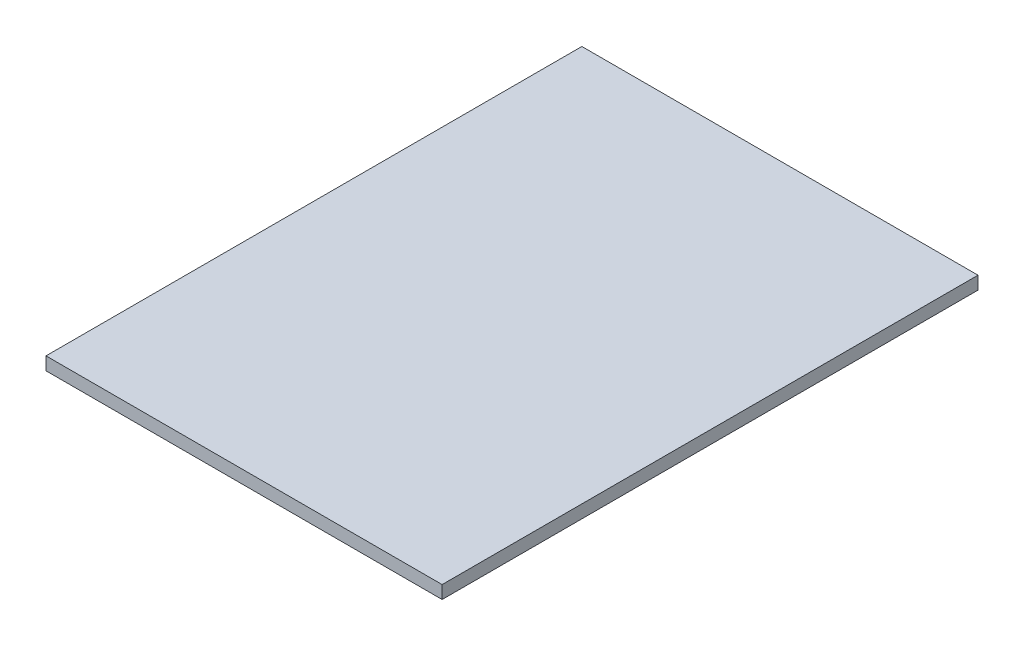
ISO-10303-21;
HEADER;
FILE_DESCRIPTION(('STEP AP214'),'2;1');
FILE_NAME('part.step','',(''),(''),'','','');
FILE_SCHEMA(('AUTOMOTIVE_DESIGN { 1 0 10303 214 1 1 1 1 }'));
ENDSEC;
DATA;
#1=APPLICATION_CONTEXT('core data for automotive mechanical design processes');
#2=APPLICATION_PROTOCOL_DEFINITION('international standard','automotive_design',2000,#1);
#3=PRODUCT_CONTEXT('',#1,'mechanical');
#4=PRODUCT('Part','Part','',(#3));
#5=PRODUCT_RELATED_PRODUCT_CATEGORY('part','',(#4));
#6=PRODUCT_DEFINITION_FORMATION('','',#4);
#7=PRODUCT_DEFINITION_CONTEXT('part definition',#1,'design');
#8=PRODUCT_DEFINITION('design','',#6,#7);
#9=PRODUCT_DEFINITION_SHAPE('','',#8);
#10=(LENGTH_UNIT() NAMED_UNIT(*) SI_UNIT(.MILLI.,.METRE.));
#11=(NAMED_UNIT(*) PLANE_ANGLE_UNIT() SI_UNIT($,.RADIAN.));
#12=(NAMED_UNIT(*) SI_UNIT($,.STERADIAN.) SOLID_ANGLE_UNIT());
#13=UNCERTAINTY_MEASURE_WITH_UNIT(LENGTH_MEASURE(1.E-05),#10,'distance_accuracy_value','');
#14=(GEOMETRIC_REPRESENTATION_CONTEXT(3) GLOBAL_UNCERTAINTY_ASSIGNED_CONTEXT((#13)) GLOBAL_UNIT_ASSIGNED_CONTEXT((#10,
#11,#12)) REPRESENTATION_CONTEXT('',''));
#15=CARTESIAN_POINT('',(0.,0.,0.));
#16=DIRECTION('',(0.,0.,1.));
#17=DIRECTION('',(1.,0.,0.));
#18=AXIS2_PLACEMENT_3D('',#15,#16,#17);
#19=CARTESIAN_POINT('',(-275.,18.,372.));
#20=DIRECTION('',(1.,0.,0.));
#21=DIRECTION('',(0.,0.,-1.));
#22=AXIS2_PLACEMENT_3D('',#19,#20,#21);
#23=PLANE('',#22);
#24=DIRECTION('',(0.,0.,1.));
#25=VECTOR('',#24,1.);
#26=CARTESIAN_POINT('',(-275.,0.,372.));
#27=LINE('',#26,#25);
#28=CARTESIAN_POINT('',(-275.,0.,-372.));
#29=VERTEX_POINT('',#28);
#30=CARTESIAN_POINT('',(-275.,0.,372.));
#31=VERTEX_POINT('',#30);
#32=EDGE_CURVE('E98',#29,#31,#27,.T.);
#33=ORIENTED_EDGE('',*,*,#32,.T.);
#34=DIRECTION('',(0.,-1.,0.));
#35=VECTOR('',#34,1.);
#36=CARTESIAN_POINT('',(-275.,18.,372.));
#37=LINE('',#36,#35);
#38=CARTESIAN_POINT('',(-275.,18.,372.));
#39=VERTEX_POINT('',#38);
#40=EDGE_CURVE('E11',#39,#31,#37,.T.);
#41=ORIENTED_EDGE('',*,*,#40,.F.);
#42=DIRECTION('',(0.,0.,1.));
#43=VECTOR('',#42,1.);
#44=CARTESIAN_POINT('',(-275.,18.,372.));
#45=LINE('',#44,#43);
#46=CARTESIAN_POINT('',(-275.,18.,-372.));
#47=VERTEX_POINT('',#46);
#48=EDGE_CURVE('E86',#47,#39,#45,.T.);
#49=ORIENTED_EDGE('',*,*,#48,.F.);
#50=DIRECTION('',(0.,-1.,0.));
#51=VECTOR('',#50,1.);
#52=CARTESIAN_POINT('',(-275.,18.,-372.));
#53=LINE('',#52,#51);
#54=EDGE_CURVE('E94',#47,#29,#53,.T.);
#55=ORIENTED_EDGE('',*,*,#54,.T.);
#56=EDGE_LOOP('',(#33,#41,#49,#55));
#57=FACE_BOUND('',#56,.T.);
#58=ADVANCED_FACE('F35',(#57),#23,.F.);
#59=CARTESIAN_POINT('',(275.,18.,372.));
#60=DIRECTION('',(0.,0.,-1.));
#61=DIRECTION('',(-1.,0.,0.));
#62=AXIS2_PLACEMENT_3D('',#59,#60,#61);
#63=PLANE('',#62);
#64=DIRECTION('',(1.,0.,0.));
#65=VECTOR('',#64,1.);
#66=CARTESIAN_POINT('',(275.,0.,372.));
#67=LINE('',#66,#65);
#68=CARTESIAN_POINT('',(275.,0.,372.));
#69=VERTEX_POINT('',#68);
#70=EDGE_CURVE('E90',#31,#69,#67,.T.);
#71=ORIENTED_EDGE('',*,*,#70,.T.);
#72=DIRECTION('',(0.,-1.,0.));
#73=VECTOR('',#72,1.);
#74=CARTESIAN_POINT('',(275.,18.,372.));
#75=LINE('',#74,#73);
#76=CARTESIAN_POINT('',(275.,18.,372.));
#77=VERTEX_POINT('',#76);
#78=EDGE_CURVE('E43',#77,#69,#75,.T.);
#79=ORIENTED_EDGE('',*,*,#78,.F.);
#80=DIRECTION('',(1.,0.,0.));
#81=VECTOR('',#80,1.);
#82=CARTESIAN_POINT('',(275.,18.,372.));
#83=LINE('',#82,#81);
#84=EDGE_CURVE('E81',#39,#77,#83,.T.);
#85=ORIENTED_EDGE('',*,*,#84,.F.);
#86=ORIENTED_EDGE('',*,*,#40,.T.);
#87=EDGE_LOOP('',(#71,#79,#85,#86));
#88=FACE_BOUND('',#87,.T.);
#89=ADVANCED_FACE('F89',(#88),#63,.F.);
#90=CARTESIAN_POINT('',(275.,18.,372.));
#91=DIRECTION('',(-1.,0.,0.));
#92=DIRECTION('',(0.,0.,1.));
#93=AXIS2_PLACEMENT_3D('',#90,#91,#92);
#94=PLANE('',#93);
#95=DIRECTION('',(0.,0.,-1.));
#96=VECTOR('',#95,1.);
#97=CARTESIAN_POINT('',(275.,0.,372.));
#98=LINE('',#97,#96);
#99=CARTESIAN_POINT('',(275.,0.,-372.));
#100=VERTEX_POINT('',#99);
#101=EDGE_CURVE('E68',#69,#100,#98,.T.);
#102=ORIENTED_EDGE('',*,*,#101,.T.);
#103=DIRECTION('',(0.,-1.,0.));
#104=VECTOR('',#103,1.);
#105=CARTESIAN_POINT('',(275.,18.,-372.));
#106=LINE('',#105,#104);
#107=CARTESIAN_POINT('',(275.,18.,-372.));
#108=VERTEX_POINT('',#107);
#109=EDGE_CURVE('E91',#108,#100,#106,.T.);
#110=ORIENTED_EDGE('',*,*,#109,.F.);
#111=DIRECTION('',(0.,0.,-1.));
#112=VECTOR('',#111,1.);
#113=CARTESIAN_POINT('',(275.,18.,372.));
#114=LINE('',#113,#112);
#115=EDGE_CURVE('E84',#77,#108,#114,.T.);
#116=ORIENTED_EDGE('',*,*,#115,.F.);
#117=ORIENTED_EDGE('',*,*,#78,.T.);
#118=EDGE_LOOP('',(#102,#110,#116,#117));
#119=FACE_BOUND('',#118,.T.);
#120=ADVANCED_FACE('F92',(#119),#94,.F.);
#121=CARTESIAN_POINT('',(275.,18.,-372.));
#122=DIRECTION('',(0.,0.,1.));
#123=DIRECTION('',(1.,0.,0.));
#124=AXIS2_PLACEMENT_3D('',#121,#122,#123);
#125=PLANE('',#124);
#126=DIRECTION('',(-1.,0.,0.));
#127=VECTOR('',#126,1.);
#128=CARTESIAN_POINT('',(275.,0.,-372.));
#129=LINE('',#128,#127);
#130=EDGE_CURVE('E74',#100,#29,#129,.T.);
#131=ORIENTED_EDGE('',*,*,#130,.T.);
#132=ORIENTED_EDGE('',*,*,#54,.F.);
#133=DIRECTION('',(-1.,0.,0.));
#134=VECTOR('',#133,1.);
#135=CARTESIAN_POINT('',(275.,18.,-372.));
#136=LINE('',#135,#134);
#137=EDGE_CURVE('E51',#108,#47,#136,.T.);
#138=ORIENTED_EDGE('',*,*,#137,.F.);
#139=ORIENTED_EDGE('',*,*,#109,.T.);
#140=EDGE_LOOP('',(#131,#132,#138,#139));
#141=FACE_BOUND('',#140,.T.);
#142=ADVANCED_FACE('F105',(#141),#125,.F.);
#143=CARTESIAN_POINT('',(0.,18.,0.));
#144=DIRECTION('',(0.,1.,0.));
#145=DIRECTION('',(0.,0.,1.));
#146=AXIS2_PLACEMENT_3D('',#143,#144,#145);
#147=PLANE('',#146);
#148=ORIENTED_EDGE('',*,*,#48,.T.);
#149=ORIENTED_EDGE('',*,*,#84,.T.);
#150=ORIENTED_EDGE('',*,*,#115,.T.);
#151=ORIENTED_EDGE('',*,*,#137,.T.);
#152=EDGE_LOOP('',(#148,#149,#150,#151));
#153=FACE_BOUND('',#152,.T.);
#154=ADVANCED_FACE('F82',(#153),#147,.T.);
#155=CARTESIAN_POINT('',(0.,0.,0.));
#156=DIRECTION('',(0.,1.,0.));
#157=DIRECTION('',(0.,0.,1.));
#158=AXIS2_PLACEMENT_3D('',#155,#156,#157);
#159=PLANE('',#158);
#160=ORIENTED_EDGE('',*,*,#32,.F.);
#161=ORIENTED_EDGE('',*,*,#130,.F.);
#162=ORIENTED_EDGE('',*,*,#101,.F.);
#163=ORIENTED_EDGE('',*,*,#70,.F.);
#164=EDGE_LOOP('',(#160,#161,#162,#163));
#165=FACE_BOUND('',#164,.T.);
#166=ADVANCED_FACE('F108',(#165),#159,.F.);
#167=CLOSED_SHELL('',(#58,#89,#120,#142,#154,#166));
#168=MANIFOLD_SOLID_BREP('B2',#167);
#169=ADVANCED_BREP_SHAPE_REPRESENTATION('',(#18,#168),#14);
#170=SHAPE_DEFINITION_REPRESENTATION(#9,#169);
ENDSEC;
END-ISO-10303-21;
